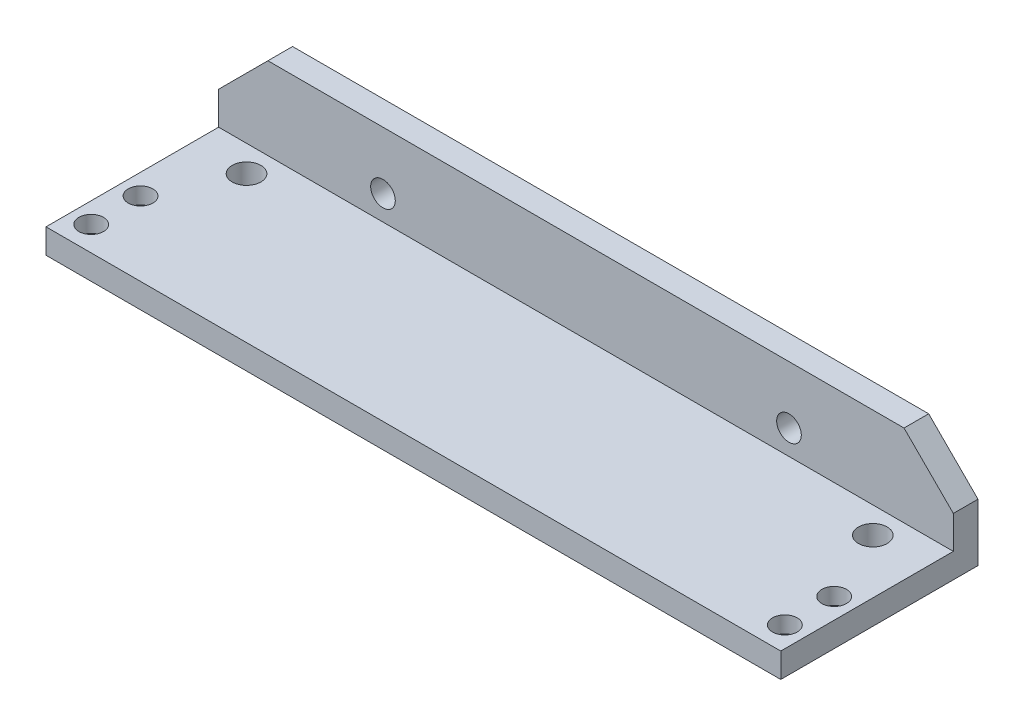
ISO-10303-21;
HEADER;
FILE_DESCRIPTION(('STEP AP214'),'2;1');
FILE_NAME('part.step','',(''),(''),'','','');
FILE_SCHEMA(('AUTOMOTIVE_DESIGN { 1 0 10303 214 1 1 1 1 }'));
ENDSEC;
DATA;
#1=APPLICATION_CONTEXT('core data for automotive mechanical design processes');
#2=APPLICATION_PROTOCOL_DEFINITION('international standard','automotive_design',2000,#1);
#3=PRODUCT_CONTEXT('',#1,'mechanical');
#4=PRODUCT('Part','Part','',(#3));
#5=PRODUCT_RELATED_PRODUCT_CATEGORY('part','',(#4));
#6=PRODUCT_DEFINITION_FORMATION('','',#4);
#7=PRODUCT_DEFINITION_CONTEXT('part definition',#1,'design');
#8=PRODUCT_DEFINITION('design','',#6,#7);
#9=PRODUCT_DEFINITION_SHAPE('','',#8);
#10=(LENGTH_UNIT() NAMED_UNIT(*) SI_UNIT(.MILLI.,.METRE.));
#11=(NAMED_UNIT(*) PLANE_ANGLE_UNIT() SI_UNIT($,.RADIAN.));
#12=(NAMED_UNIT(*) SI_UNIT($,.STERADIAN.) SOLID_ANGLE_UNIT());
#13=UNCERTAINTY_MEASURE_WITH_UNIT(LENGTH_MEASURE(1.E-05),#10,'distance_accuracy_value','');
#14=(GEOMETRIC_REPRESENTATION_CONTEXT(3) GLOBAL_UNCERTAINTY_ASSIGNED_CONTEXT((#13)) GLOBAL_UNIT_ASSIGNED_CONTEXT((#10,
#11,#12)) REPRESENTATION_CONTEXT('',''));
#15=CARTESIAN_POINT('',(0.,0.,0.));
#16=DIRECTION('',(0.,0.,1.));
#17=DIRECTION('',(1.,0.,0.));
#18=AXIS2_PLACEMENT_3D('',#15,#16,#17);
#19=CARTESIAN_POINT('',(0.,-4.10740038617406,24.));
#20=DIRECTION('',(0.,1.,0.));
#21=DIRECTION('',(0.,0.,1.));
#22=AXIS2_PLACEMENT_3D('',#19,#20,#21);
#23=PLANE('',#22);
#24=CARTESIAN_POINT('',(48.6489300998573,-4.10740038617406,15.));
#25=DIRECTION('',(0.,1.,0.));
#26=DIRECTION('',(0.,0.,1.));
#27=AXIS2_PLACEMENT_3D('',#24,#25,#26);
#28=CIRCLE('',#27,2.25);
#29=CARTESIAN_POINT('',(48.6489300998573,-4.10740038617406,17.25));
#30=VERTEX_POINT('',#29);
#31=EDGE_CURVE('E569',#30,#30,#28,.T.);
#32=ORIENTED_EDGE('',*,*,#31,.T.);
#33=EDGE_LOOP('',(#32));
#34=FACE_BOUND('',#33,.T.);
#35=CARTESIAN_POINT('',(-35.7510699001427,-4.10740038617406,15.));
#36=DIRECTION('',(0.,1.,0.));
#37=DIRECTION('',(0.,0.,1.));
#38=AXIS2_PLACEMENT_3D('',#35,#36,#37);
#39=CIRCLE('',#38,2.25);
#40=CARTESIAN_POINT('',(-35.7510699001427,-4.10740038617406,17.25));
#41=VERTEX_POINT('',#40);
#42=EDGE_CURVE('E157',#41,#41,#39,.T.);
#43=ORIENTED_EDGE('',*,*,#42,.T.);
#44=EDGE_LOOP('',(#43));
#45=FACE_BOUND('',#44,.T.);
#46=CARTESIAN_POINT('',(44.5489300998573,-4.10740038617406,6.2));
#47=DIRECTION('',(0.,1.,0.));
#48=DIRECTION('',(0.,0.,1.));
#49=AXIS2_PLACEMENT_3D('',#46,#47,#48);
#50=CIRCLE('',#49,1.75);
#51=CARTESIAN_POINT('',(44.5489300998573,-4.10740038617406,7.95));
#52=VERTEX_POINT('',#51);
#53=EDGE_CURVE('E172',#52,#52,#50,.F.);
#54=ORIENTED_EDGE('',*,*,#53,.F.);
#55=EDGE_LOOP('',(#54));
#56=FACE_BOUND('',#55,.T.);
#57=CARTESIAN_POINT('',(-31.6510699001427,-4.10740038617406,6.2));
#58=DIRECTION('',(0.,1.,0.));
#59=DIRECTION('',(0.,0.,1.));
#60=AXIS2_PLACEMENT_3D('',#57,#58,#59);
#61=CIRCLE('',#60,1.75);
#62=CARTESIAN_POINT('',(-31.6510699001427,-4.10740038617406,7.95));
#63=VERTEX_POINT('',#62);
#64=EDGE_CURVE('E155',#63,#63,#61,.F.);
#65=ORIENTED_EDGE('',*,*,#64,.F.);
#66=EDGE_LOOP('',(#65));
#67=FACE_BOUND('',#66,.T.);
#68=DIRECTION('',(1.,0.,0.));
#69=VECTOR('',#68,1.);
#70=CARTESIAN_POINT('',(0.,-4.10740038617406,0.));
#71=LINE('',#70,#69);
#72=CARTESIAN_POINT('',(-38.2510699001427,-4.10740038617406,0.));
#73=VERTEX_POINT('',#72);
#74=CARTESIAN_POINT('',(51.1489300998573,-4.10740038617406,0.));
#75=VERTEX_POINT('',#74);
#76=EDGE_CURVE('E190',#73,#75,#71,.T.);
#77=ORIENTED_EDGE('',*,*,#76,.T.);
#78=DIRECTION('',(0.,0.,-1.));
#79=VECTOR('',#78,1.);
#80=CARTESIAN_POINT('',(51.1489300998573,-4.10740038617406,24.));
#81=LINE('',#80,#79);
#82=CARTESIAN_POINT('',(51.1489300998573,-4.10740038617406,24.));
#83=VERTEX_POINT('',#82);
#84=EDGE_CURVE('E134',#83,#75,#81,.T.);
#85=ORIENTED_EDGE('',*,*,#84,.F.);
#86=DIRECTION('',(1.,0.,0.));
#87=VECTOR('',#86,1.);
#88=CARTESIAN_POINT('',(0.,-4.10740038617406,24.));
#89=LINE('',#88,#87);
#90=CARTESIAN_POINT('',(-38.2510699001427,-4.10740038617406,24.));
#91=VERTEX_POINT('',#90);
#92=EDGE_CURVE('E191',#91,#83,#89,.T.);
#93=ORIENTED_EDGE('',*,*,#92,.F.);
#94=DIRECTION('',(0.,0.,-1.));
#95=VECTOR('',#94,1.);
#96=CARTESIAN_POINT('',(-38.2510699001427,-4.10740038617406,24.));
#97=LINE('',#96,#95);
#98=EDGE_CURVE('E202',#91,#73,#97,.T.);
#99=ORIENTED_EDGE('',*,*,#98,.T.);
#100=EDGE_LOOP('',(#77,#85,#93,#99));
#101=FACE_BOUND('',#100,.T.);
#102=CARTESIAN_POINT('',(48.6489300998573,-4.10740038617406,21.));
#103=DIRECTION('',(0.,1.,0.));
#104=DIRECTION('',(0.,0.,1.));
#105=AXIS2_PLACEMENT_3D('',#102,#103,#104);
#106=CIRCLE('',#105,2.25);
#107=CARTESIAN_POINT('',(48.6489300998573,-4.10740038617406,23.25));
#108=VERTEX_POINT('',#107);
#109=EDGE_CURVE('E575',#108,#108,#106,.T.);
#110=ORIENTED_EDGE('',*,*,#109,.T.);
#111=EDGE_LOOP('',(#110));
#112=FACE_BOUND('',#111,.T.);
#113=CARTESIAN_POINT('',(-35.7510699001427,-4.10740038617406,21.));
#114=DIRECTION('',(0.,1.,0.));
#115=DIRECTION('',(0.,0.,1.));
#116=AXIS2_PLACEMENT_3D('',#113,#114,#115);
#117=CIRCLE('',#116,2.25);
#118=CARTESIAN_POINT('',(-35.7510699001427,-4.10740038617406,23.25));
#119=VERTEX_POINT('',#118);
#120=EDGE_CURVE('E573',#119,#119,#117,.T.);
#121=ORIENTED_EDGE('',*,*,#120,.T.);
#122=EDGE_LOOP('',(#121));
#123=FACE_BOUND('',#122,.T.);
#124=ADVANCED_FACE('F48',(#34,#45,#56,#67,#101,#112,#123),#23,.F.);
#125=CARTESIAN_POINT('',(51.1489300998573,0.,3.));
#126=DIRECTION('',(-1.,0.,0.));
#127=DIRECTION('',(0.,0.,1.));
#128=AXIS2_PLACEMENT_3D('',#125,#126,#127);
#129=PLANE('',#128);
#130=DIRECTION('',(0.,1.,0.));
#131=VECTOR('',#130,1.);
#132=CARTESIAN_POINT('',(51.1489300998573,0.,0.));
#133=LINE('',#132,#131);
#134=CARTESIAN_POINT('',(51.1489300998573,2.89259961382594,0.));
#135=VERTEX_POINT('',#134);
#136=EDGE_CURVE('E137',#75,#135,#133,.T.);
#137=ORIENTED_EDGE('',*,*,#136,.T.);
#138=DIRECTION('',(0.,0.,-1.));
#139=VECTOR('',#138,1.);
#140=CARTESIAN_POINT('',(51.1489300998573,2.89259961382594,3.));
#141=LINE('',#140,#139);
#142=CARTESIAN_POINT('',(51.1489300998573,2.89259961382594,3.));
#143=VERTEX_POINT('',#142);
#144=EDGE_CURVE('E12',#143,#135,#141,.T.);
#145=ORIENTED_EDGE('',*,*,#144,.F.);
#146=DIRECTION('',(0.,1.,0.));
#147=VECTOR('',#146,1.);
#148=CARTESIAN_POINT('',(51.1489300998573,0.,3.));
#149=LINE('',#148,#147);
#150=CARTESIAN_POINT('',(51.1489300998573,-1.10740038617406,3.));
#151=VERTEX_POINT('',#150);
#152=EDGE_CURVE('E218',#151,#143,#149,.T.);
#153=ORIENTED_EDGE('',*,*,#152,.F.);
#154=DIRECTION('',(0.,0.,-1.));
#155=VECTOR('',#154,1.);
#156=CARTESIAN_POINT('',(51.1489300998573,-1.10740038617406,24.));
#157=LINE('',#156,#155);
#158=CARTESIAN_POINT('',(51.1489300998573,-1.10740038617406,24.));
#159=VERTEX_POINT('',#158);
#160=EDGE_CURVE('E67',#159,#151,#157,.T.);
#161=ORIENTED_EDGE('',*,*,#160,.F.);
#162=DIRECTION('',(0.,1.,0.));
#163=VECTOR('',#162,1.);
#164=CARTESIAN_POINT('',(51.1489300998573,0.,24.));
#165=LINE('',#164,#163);
#166=EDGE_CURVE('E194',#83,#159,#165,.T.);
#167=ORIENTED_EDGE('',*,*,#166,.F.);
#168=ORIENTED_EDGE('',*,*,#84,.T.);
#169=EDGE_LOOP('',(#137,#145,#153,#161,#167,#168));
#170=FACE_BOUND('',#169,.T.);
#171=ADVANCED_FACE('F222',(#170),#129,.F.);
#172=CARTESIAN_POINT('',(27.0207648568417,27.0207648568416,3.));
#173=DIRECTION('',(-0.707106781186548,-0.707106781186547,0.));
#174=DIRECTION('',(0.707106781186547,-0.707106781186548,0.));
#175=AXIS2_PLACEMENT_3D('',#172,#173,#174);
#176=PLANE('',#175);
#177=DIRECTION('',(-0.707106781186547,0.707106781186548,0.));
#178=VECTOR('',#177,1.);
#179=CARTESIAN_POINT('',(27.0207648568417,27.0207648568416,0.));
#180=LINE('',#179,#178);
#181=CARTESIAN_POINT('',(45.1489300998574,8.89259961382595,0.));
#182=VERTEX_POINT('',#181);
#183=EDGE_CURVE('E140',#135,#182,#180,.T.);
#184=ORIENTED_EDGE('',*,*,#183,.T.);
#185=DIRECTION('',(0.,0.,-1.));
#186=VECTOR('',#185,1.);
#187=CARTESIAN_POINT('',(45.1489300998574,8.89259961382595,3.));
#188=LINE('',#187,#186);
#189=CARTESIAN_POINT('',(45.1489300998574,8.89259961382595,3.));
#190=VERTEX_POINT('',#189);
#191=EDGE_CURVE('E58',#190,#182,#188,.T.);
#192=ORIENTED_EDGE('',*,*,#191,.F.);
#193=DIRECTION('',(-0.707106781186547,0.707106781186548,0.));
#194=VECTOR('',#193,1.);
#195=CARTESIAN_POINT('',(27.0207648568417,27.0207648568416,3.));
#196=LINE('',#195,#194);
#197=EDGE_CURVE('E101',#143,#190,#196,.T.);
#198=ORIENTED_EDGE('',*,*,#197,.F.);
#199=ORIENTED_EDGE('',*,*,#144,.T.);
#200=EDGE_LOOP('',(#184,#192,#198,#199));
#201=FACE_BOUND('',#200,.T.);
#202=ADVANCED_FACE('F224',(#201),#176,.F.);
#203=CARTESIAN_POINT('',(0.,8.89259961382594,3.));
#204=DIRECTION('',(0.,-1.,0.));
#205=DIRECTION('',(1.,0.,0.));
#206=AXIS2_PLACEMENT_3D('',#203,#204,#205);
#207=PLANE('',#206);
#208=DIRECTION('',(-1.,0.,0.));
#209=VECTOR('',#208,1.);
#210=CARTESIAN_POINT('',(0.,8.89259961382594,0.));
#211=LINE('',#210,#209);
#212=CARTESIAN_POINT('',(-32.2510699001427,8.89259961382594,0.));
#213=VERTEX_POINT('',#212);
#214=EDGE_CURVE('E119',#182,#213,#211,.T.);
#215=ORIENTED_EDGE('',*,*,#214,.T.);
#216=DIRECTION('',(0.,0.,-1.));
#217=VECTOR('',#216,1.);
#218=CARTESIAN_POINT('',(-32.2510699001427,8.89259961382594,3.));
#219=LINE('',#218,#217);
#220=CARTESIAN_POINT('',(-32.2510699001427,8.89259961382594,3.));
#221=VERTEX_POINT('',#220);
#222=EDGE_CURVE('E86',#221,#213,#219,.T.);
#223=ORIENTED_EDGE('',*,*,#222,.F.);
#224=DIRECTION('',(-1.,0.,0.));
#225=VECTOR('',#224,1.);
#226=CARTESIAN_POINT('',(0.,8.89259961382594,3.));
#227=LINE('',#226,#225);
#228=EDGE_CURVE('E110',#190,#221,#227,.T.);
#229=ORIENTED_EDGE('',*,*,#228,.F.);
#230=ORIENTED_EDGE('',*,*,#191,.T.);
#231=EDGE_LOOP('',(#215,#223,#229,#230));
#232=FACE_BOUND('',#231,.T.);
#233=ADVANCED_FACE('F117',(#232),#207,.F.);
#234=CARTESIAN_POINT('',(-20.5718347569843,20.5718347569843,3.));
#235=DIRECTION('',(-0.707106781186548,0.707106781186547,0.));
#236=DIRECTION('',(-0.707106781186547,-0.707106781186548,0.));
#237=AXIS2_PLACEMENT_3D('',#234,#235,#236);
#238=PLANE('',#237);
#239=DIRECTION('',(0.707106781186547,0.707106781186548,0.));
#240=VECTOR('',#239,1.);
#241=CARTESIAN_POINT('',(-20.5718347569843,20.5718347569843,0.));
#242=LINE('',#241,#240);
#243=CARTESIAN_POINT('',(-38.2510699001427,2.89259961382594,0.));
#244=VERTEX_POINT('',#243);
#245=EDGE_CURVE('E143',#244,#213,#242,.T.);
#246=ORIENTED_EDGE('',*,*,#245,.F.);
#247=DIRECTION('',(0.,0.,-1.));
#248=VECTOR('',#247,1.);
#249=CARTESIAN_POINT('',(-38.2510699001427,2.89259961382594,3.));
#250=LINE('',#249,#248);
#251=CARTESIAN_POINT('',(-38.2510699001427,2.89259961382594,3.));
#252=VERTEX_POINT('',#251);
#253=EDGE_CURVE('E93',#252,#244,#250,.T.);
#254=ORIENTED_EDGE('',*,*,#253,.F.);
#255=DIRECTION('',(0.707106781186547,0.707106781186548,0.));
#256=VECTOR('',#255,1.);
#257=CARTESIAN_POINT('',(-20.5718347569843,20.5718347569843,3.));
#258=LINE('',#257,#256);
#259=EDGE_CURVE('E113',#252,#221,#258,.T.);
#260=ORIENTED_EDGE('',*,*,#259,.T.);
#261=ORIENTED_EDGE('',*,*,#222,.T.);
#262=EDGE_LOOP('',(#246,#254,#260,#261));
#263=FACE_BOUND('',#262,.T.);
#264=ADVANCED_FACE('F122',(#263),#238,.T.);
#265=CARTESIAN_POINT('',(-38.2510699001427,0.,3.));
#266=DIRECTION('',(1.,0.,0.));
#267=DIRECTION('',(0.,0.,-1.));
#268=AXIS2_PLACEMENT_3D('',#265,#266,#267);
#269=PLANE('',#268);
#270=DIRECTION('',(0.,-1.,0.));
#271=VECTOR('',#270,1.);
#272=CARTESIAN_POINT('',(-38.2510699001427,0.,0.));
#273=LINE('',#272,#271);
#274=EDGE_CURVE('E145',#244,#73,#273,.T.);
#275=ORIENTED_EDGE('',*,*,#274,.T.);
#276=ORIENTED_EDGE('',*,*,#98,.F.);
#277=DIRECTION('',(0.,-1.,0.));
#278=VECTOR('',#277,1.);
#279=CARTESIAN_POINT('',(-38.2510699001427,0.,24.));
#280=LINE('',#279,#278);
#281=CARTESIAN_POINT('',(-38.2510699001427,-1.10740038617406,24.));
#282=VERTEX_POINT('',#281);
#283=EDGE_CURVE('E199',#282,#91,#280,.T.);
#284=ORIENTED_EDGE('',*,*,#283,.F.);
#285=DIRECTION('',(0.,0.,-1.));
#286=VECTOR('',#285,1.);
#287=CARTESIAN_POINT('',(-38.2510699001427,-1.10740038617406,24.));
#288=LINE('',#287,#286);
#289=CARTESIAN_POINT('',(-38.2510699001427,-1.10740038617406,3.));
#290=VERTEX_POINT('',#289);
#291=EDGE_CURVE('E207',#282,#290,#288,.T.);
#292=ORIENTED_EDGE('',*,*,#291,.T.);
#293=DIRECTION('',(0.,-1.,0.));
#294=VECTOR('',#293,1.);
#295=CARTESIAN_POINT('',(-38.2510699001427,0.,3.));
#296=LINE('',#295,#294);
#297=EDGE_CURVE('E123',#252,#290,#296,.T.);
#298=ORIENTED_EDGE('',*,*,#297,.F.);
#299=ORIENTED_EDGE('',*,*,#253,.T.);
#300=EDGE_LOOP('',(#275,#276,#284,#292,#298,#299));
#301=FACE_BOUND('',#300,.T.);
#302=ADVANCED_FACE('F230',(#301),#269,.F.);
#303=CARTESIAN_POINT('',(-18.2510699001427,1.89259961382594,3.));
#304=DIRECTION('',(0.,0.,-1.));
#305=DIRECTION('',(-1.,0.,0.));
#306=AXIS2_PLACEMENT_3D('',#303,#304,#305);
#307=CYLINDRICAL_SURFACE('',#306,1.5);
#308=CARTESIAN_POINT('',(-18.2510699001427,1.89259961382594,3.));
#309=DIRECTION('',(0.,0.,1.));
#310=DIRECTION('',(1.,0.,0.));
#311=AXIS2_PLACEMENT_3D('',#308,#309,#310);
#312=CIRCLE('',#311,1.5);
#313=CARTESIAN_POINT('',(-16.7510699001427,1.89259961382594,3.));
#314=VERTEX_POINT('',#313);
#315=EDGE_CURVE('E215',#314,#314,#312,.T.);
#316=ORIENTED_EDGE('',*,*,#315,.T.);
#317=EDGE_LOOP('',(#316));
#318=FACE_BOUND('',#317,.T.);
#319=CARTESIAN_POINT('',(-18.2510699001427,1.89259961382594,0.));
#320=DIRECTION('',(0.,0.,1.));
#321=DIRECTION('',(1.,0.,0.));
#322=AXIS2_PLACEMENT_3D('',#319,#320,#321);
#323=CIRCLE('',#322,1.5);
#324=CARTESIAN_POINT('',(-16.7510699001427,1.89259961382594,0.));
#325=VERTEX_POINT('',#324);
#326=EDGE_CURVE('E133',#325,#325,#323,.T.);
#327=ORIENTED_EDGE('',*,*,#326,.F.);
#328=EDGE_LOOP('',(#327));
#329=FACE_BOUND('',#328,.T.);
#330=ADVANCED_FACE('F280',(#318,#329),#307,.F.);
#331=CARTESIAN_POINT('',(31.1489300998573,1.89259961382594,3.));
#332=DIRECTION('',(0.,0.,-1.));
#333=DIRECTION('',(-1.,0.,0.));
#334=AXIS2_PLACEMENT_3D('',#331,#332,#333);
#335=CYLINDRICAL_SURFACE('',#334,1.5);
#336=CARTESIAN_POINT('',(31.1489300998573,1.89259961382594,3.));
#337=DIRECTION('',(0.,0.,1.));
#338=DIRECTION('',(1.,0.,0.));
#339=AXIS2_PLACEMENT_3D('',#336,#337,#338);
#340=CIRCLE('',#339,1.5);
#341=CARTESIAN_POINT('',(32.6489300998573,1.89259961382594,3.));
#342=VERTEX_POINT('',#341);
#343=EDGE_CURVE('E147',#342,#342,#340,.T.);
#344=ORIENTED_EDGE('',*,*,#343,.T.);
#345=EDGE_LOOP('',(#344));
#346=FACE_BOUND('',#345,.T.);
#347=CARTESIAN_POINT('',(31.1489300998573,1.89259961382594,0.));
#348=DIRECTION('',(0.,0.,1.));
#349=DIRECTION('',(1.,0.,0.));
#350=AXIS2_PLACEMENT_3D('',#347,#348,#349);
#351=CIRCLE('',#350,1.5);
#352=CARTESIAN_POINT('',(32.6489300998573,1.89259961382594,0.));
#353=VERTEX_POINT('',#352);
#354=EDGE_CURVE('E130',#353,#353,#351,.T.);
#355=ORIENTED_EDGE('',*,*,#354,.F.);
#356=EDGE_LOOP('',(#355));
#357=FACE_BOUND('',#356,.T.);
#358=ADVANCED_FACE('F50',(#346,#357),#335,.F.);
#359=CARTESIAN_POINT('',(0.,0.,3.));
#360=DIRECTION('',(0.,0.,1.));
#361=DIRECTION('',(1.,0.,0.));
#362=AXIS2_PLACEMENT_3D('',#359,#360,#361);
#363=PLANE('',#362);
#364=ORIENTED_EDGE('',*,*,#343,.F.);
#365=EDGE_LOOP('',(#364));
#366=FACE_BOUND('',#365,.T.);
#367=ORIENTED_EDGE('',*,*,#315,.F.);
#368=EDGE_LOOP('',(#367));
#369=FACE_BOUND('',#368,.T.);
#370=ORIENTED_EDGE('',*,*,#152,.T.);
#371=ORIENTED_EDGE('',*,*,#197,.T.);
#372=ORIENTED_EDGE('',*,*,#228,.T.);
#373=ORIENTED_EDGE('',*,*,#259,.F.);
#374=ORIENTED_EDGE('',*,*,#297,.T.);
#375=DIRECTION('',(1.,0.,0.));
#376=VECTOR('',#375,1.);
#377=CARTESIAN_POINT('',(0.,-1.10740038617406,3.));
#378=LINE('',#377,#376);
#379=EDGE_CURVE('E125',#290,#151,#378,.T.);
#380=ORIENTED_EDGE('',*,*,#379,.T.);
#381=EDGE_LOOP('',(#370,#371,#372,#373,#374,#380));
#382=FACE_BOUND('',#381,.T.);
#383=ADVANCED_FACE('F111',(#366,#369,#382),#363,.T.);
#384=CARTESIAN_POINT('',(0.,0.,0.));
#385=DIRECTION('',(0.,0.,1.));
#386=DIRECTION('',(1.,0.,0.));
#387=AXIS2_PLACEMENT_3D('',#384,#385,#386);
#388=PLANE('',#387);
#389=ORIENTED_EDGE('',*,*,#354,.T.);
#390=EDGE_LOOP('',(#389));
#391=FACE_BOUND('',#390,.T.);
#392=ORIENTED_EDGE('',*,*,#326,.T.);
#393=EDGE_LOOP('',(#392));
#394=FACE_BOUND('',#393,.T.);
#395=ORIENTED_EDGE('',*,*,#136,.F.);
#396=ORIENTED_EDGE('',*,*,#76,.F.);
#397=ORIENTED_EDGE('',*,*,#274,.F.);
#398=ORIENTED_EDGE('',*,*,#245,.T.);
#399=ORIENTED_EDGE('',*,*,#214,.F.);
#400=ORIENTED_EDGE('',*,*,#183,.F.);
#401=EDGE_LOOP('',(#395,#396,#397,#398,#399,#400));
#402=FACE_BOUND('',#401,.T.);
#403=ADVANCED_FACE('F226',(#391,#394,#402),#388,.F.);
#404=CARTESIAN_POINT('',(0.,-1.10740038617406,24.));
#405=DIRECTION('',(0.,1.,0.));
#406=DIRECTION('',(0.,0.,1.));
#407=AXIS2_PLACEMENT_3D('',#404,#405,#406);
#408=PLANE('',#407);
#409=CARTESIAN_POINT('',(44.5489300998573,-1.10740038617406,6.2));
#410=DIRECTION('',(0.,1.,0.));
#411=DIRECTION('',(0.,0.,1.));
#412=AXIS2_PLACEMENT_3D('',#409,#410,#411);
#413=CIRCLE('',#412,1.75);
#414=CARTESIAN_POINT('',(44.5489300998573,-1.10740038617406,7.95));
#415=VERTEX_POINT('',#414);
#416=EDGE_CURVE('E177',#415,#415,#413,.T.);
#417=ORIENTED_EDGE('',*,*,#416,.F.);
#418=EDGE_LOOP('',(#417));
#419=FACE_BOUND('',#418,.T.);
#420=CARTESIAN_POINT('',(-35.7510699001427,-1.10740038617406,21.));
#421=DIRECTION('',(0.,1.,0.));
#422=DIRECTION('',(0.,0.,1.));
#423=AXIS2_PLACEMENT_3D('',#420,#421,#422);
#424=CIRCLE('',#423,1.5);
#425=CARTESIAN_POINT('',(-35.7510699001427,-1.10740038617406,22.5));
#426=VERTEX_POINT('',#425);
#427=EDGE_CURVE('E173',#426,#426,#424,.T.);
#428=ORIENTED_EDGE('',*,*,#427,.F.);
#429=EDGE_LOOP('',(#428));
#430=FACE_BOUND('',#429,.T.);
#431=CARTESIAN_POINT('',(-35.7510699001427,-1.10740038617406,15.));
#432=DIRECTION('',(0.,1.,0.));
#433=DIRECTION('',(0.,0.,1.));
#434=AXIS2_PLACEMENT_3D('',#431,#432,#433);
#435=CIRCLE('',#434,1.5);
#436=CARTESIAN_POINT('',(-35.7510699001427,-1.10740038617406,16.5));
#437=VERTEX_POINT('',#436);
#438=EDGE_CURVE('E176',#437,#437,#435,.T.);
#439=ORIENTED_EDGE('',*,*,#438,.F.);
#440=EDGE_LOOP('',(#439));
#441=FACE_BOUND('',#440,.T.);
#442=CARTESIAN_POINT('',(48.6489300998573,-1.10740038617406,21.));
#443=DIRECTION('',(0.,1.,0.));
#444=DIRECTION('',(0.,0.,1.));
#445=AXIS2_PLACEMENT_3D('',#442,#443,#444);
#446=CIRCLE('',#445,1.5);
#447=CARTESIAN_POINT('',(48.6489300998573,-1.10740038617406,22.5));
#448=VERTEX_POINT('',#447);
#449=EDGE_CURVE('E182',#448,#448,#446,.T.);
#450=ORIENTED_EDGE('',*,*,#449,.F.);
#451=EDGE_LOOP('',(#450));
#452=FACE_BOUND('',#451,.T.);
#453=CARTESIAN_POINT('',(-31.6510699001427,-1.10740038617406,6.2));
#454=DIRECTION('',(0.,1.,0.));
#455=DIRECTION('',(0.,0.,1.));
#456=AXIS2_PLACEMENT_3D('',#453,#454,#455);
#457=CIRCLE('',#456,1.75);
#458=CARTESIAN_POINT('',(-31.6510699001427,-1.10740038617406,7.95));
#459=VERTEX_POINT('',#458);
#460=EDGE_CURVE('E169',#459,#459,#457,.T.);
#461=ORIENTED_EDGE('',*,*,#460,.F.);
#462=EDGE_LOOP('',(#461));
#463=FACE_BOUND('',#462,.T.);
#464=CARTESIAN_POINT('',(48.6489300998573,-1.10740038617406,15.));
#465=DIRECTION('',(0.,1.,0.));
#466=DIRECTION('',(0.,0.,1.));
#467=AXIS2_PLACEMENT_3D('',#464,#465,#466);
#468=CIRCLE('',#467,1.5);
#469=CARTESIAN_POINT('',(48.6489300998573,-1.10740038617406,16.5));
#470=VERTEX_POINT('',#469);
#471=EDGE_CURVE('E185',#470,#470,#468,.T.);
#472=ORIENTED_EDGE('',*,*,#471,.F.);
#473=EDGE_LOOP('',(#472));
#474=FACE_BOUND('',#473,.T.);
#475=ORIENTED_EDGE('',*,*,#379,.F.);
#476=ORIENTED_EDGE('',*,*,#291,.F.);
#477=DIRECTION('',(1.,0.,0.));
#478=VECTOR('',#477,1.);
#479=CARTESIAN_POINT('',(0.,-1.10740038617406,24.));
#480=LINE('',#479,#478);
#481=EDGE_CURVE('E197',#282,#159,#480,.T.);
#482=ORIENTED_EDGE('',*,*,#481,.T.);
#483=ORIENTED_EDGE('',*,*,#160,.T.);
#484=EDGE_LOOP('',(#475,#476,#482,#483));
#485=FACE_BOUND('',#484,.T.);
#486=ADVANCED_FACE('F251',(#419,#430,#441,#452,#463,#474,#485),#408,.T.);
#487=CARTESIAN_POINT('',(0.,0.,24.));
#488=DIRECTION('',(0.,0.,1.));
#489=DIRECTION('',(1.,0.,0.));
#490=AXIS2_PLACEMENT_3D('',#487,#488,#489);
#491=PLANE('',#490);
#492=ORIENTED_EDGE('',*,*,#92,.T.);
#493=ORIENTED_EDGE('',*,*,#166,.T.);
#494=ORIENTED_EDGE('',*,*,#481,.F.);
#495=ORIENTED_EDGE('',*,*,#283,.T.);
#496=EDGE_LOOP('',(#492,#493,#494,#495));
#497=FACE_BOUND('',#496,.T.);
#498=ADVANCED_FACE('F242',(#497),#491,.T.);
#499=CARTESIAN_POINT('',(48.6489300998573,-4.10840038617406,15.));
#500=DIRECTION('',(0.,1.,0.));
#501=DIRECTION('',(0.,0.,1.));
#502=AXIS2_PLACEMENT_3D('',#499,#500,#501);
#503=CYLINDRICAL_SURFACE('',#502,1.5);
#504=CARTESIAN_POINT('',(48.6489300998573,-3.10740038617406,15.));
#505=DIRECTION('',(0.,1.,0.));
#506=DIRECTION('',(0.,0.,1.));
#507=AXIS2_PLACEMENT_3D('',#504,#505,#506);
#508=CIRCLE('',#507,1.5);
#509=CARTESIAN_POINT('',(48.6489300998573,-3.10740038617406,16.5));
#510=VERTEX_POINT('',#509);
#511=EDGE_CURVE('E52',#510,#510,#508,.F.);
#512=ORIENTED_EDGE('',*,*,#511,.T.);
#513=EDGE_LOOP('',(#512));
#514=FACE_BOUND('',#513,.T.);
#515=ORIENTED_EDGE('',*,*,#471,.T.);
#516=EDGE_LOOP('',(#515));
#517=FACE_BOUND('',#516,.T.);
#518=ADVANCED_FACE('F259',(#514,#517),#503,.F.);
#519=CARTESIAN_POINT('',(-31.6510699001427,-4.10840038617406,6.2));
#520=DIRECTION('',(0.,1.,0.));
#521=DIRECTION('',(0.,0.,1.));
#522=AXIS2_PLACEMENT_3D('',#519,#520,#521);
#523=CYLINDRICAL_SURFACE('',#522,1.75);
#524=ORIENTED_EDGE('',*,*,#460,.T.);
#525=EDGE_LOOP('',(#524));
#526=FACE_BOUND('',#525,.T.);
#527=ORIENTED_EDGE('',*,*,#64,.T.);
#528=EDGE_LOOP('',(#527));
#529=FACE_BOUND('',#528,.T.);
#530=ADVANCED_FACE('F340',(#526,#529),#523,.F.);
#531=CARTESIAN_POINT('',(48.6489300998573,-4.10840038617406,21.));
#532=DIRECTION('',(0.,1.,0.));
#533=DIRECTION('',(0.,0.,1.));
#534=AXIS2_PLACEMENT_3D('',#531,#532,#533);
#535=CYLINDRICAL_SURFACE('',#534,1.5);
#536=CARTESIAN_POINT('',(48.6489300998573,-3.10740038617406,21.));
#537=DIRECTION('',(0.,1.,0.));
#538=DIRECTION('',(0.,0.,1.));
#539=AXIS2_PLACEMENT_3D('',#536,#537,#538);
#540=CIRCLE('',#539,1.5);
#541=CARTESIAN_POINT('',(48.6489300998573,-3.10740038617406,22.5));
#542=VERTEX_POINT('',#541);
#543=EDGE_CURVE('E149',#542,#542,#540,.F.);
#544=ORIENTED_EDGE('',*,*,#543,.T.);
#545=EDGE_LOOP('',(#544));
#546=FACE_BOUND('',#545,.T.);
#547=ORIENTED_EDGE('',*,*,#449,.T.);
#548=EDGE_LOOP('',(#547));
#549=FACE_BOUND('',#548,.T.);
#550=ADVANCED_FACE('F346',(#546,#549),#535,.F.);
#551=CARTESIAN_POINT('',(-35.7510699001427,-4.10840038617406,15.));
#552=DIRECTION('',(0.,1.,0.));
#553=DIRECTION('',(0.,0.,1.));
#554=AXIS2_PLACEMENT_3D('',#551,#552,#553);
#555=CYLINDRICAL_SURFACE('',#554,1.5);
#556=CARTESIAN_POINT('',(-35.7510699001427,-3.10740038617406,15.));
#557=DIRECTION('',(0.,1.,0.));
#558=DIRECTION('',(0.,0.,1.));
#559=AXIS2_PLACEMENT_3D('',#556,#557,#558);
#560=CIRCLE('',#559,1.5);
#561=CARTESIAN_POINT('',(-35.7510699001427,-3.10740038617406,16.5));
#562=VERTEX_POINT('',#561);
#563=EDGE_CURVE('E162',#562,#562,#560,.T.);
#564=ORIENTED_EDGE('',*,*,#563,.F.);
#565=EDGE_LOOP('',(#564));
#566=FACE_BOUND('',#565,.T.);
#567=ORIENTED_EDGE('',*,*,#438,.T.);
#568=EDGE_LOOP('',(#567));
#569=FACE_BOUND('',#568,.T.);
#570=ADVANCED_FACE('F390',(#566,#569),#555,.F.);
#571=CARTESIAN_POINT('',(-35.7510699001427,-4.10840038617406,21.));
#572=DIRECTION('',(0.,1.,0.));
#573=DIRECTION('',(0.,0.,1.));
#574=AXIS2_PLACEMENT_3D('',#571,#572,#573);
#575=CYLINDRICAL_SURFACE('',#574,1.5);
#576=CARTESIAN_POINT('',(-35.7510699001427,-3.10740038617406,21.));
#577=DIRECTION('',(0.,1.,0.));
#578=DIRECTION('',(0.,0.,1.));
#579=AXIS2_PLACEMENT_3D('',#576,#577,#578);
#580=CIRCLE('',#579,1.5);
#581=CARTESIAN_POINT('',(-35.7510699001427,-3.10740038617406,22.5));
#582=VERTEX_POINT('',#581);
#583=EDGE_CURVE('E577',#582,#582,#580,.T.);
#584=ORIENTED_EDGE('',*,*,#583,.F.);
#585=EDGE_LOOP('',(#584));
#586=FACE_BOUND('',#585,.T.);
#587=ORIENTED_EDGE('',*,*,#427,.T.);
#588=EDGE_LOOP('',(#587));
#589=FACE_BOUND('',#588,.T.);
#590=ADVANCED_FACE('F362',(#586,#589),#575,.F.);
#591=CARTESIAN_POINT('',(44.5489300998573,-4.10840038617406,6.2));
#592=DIRECTION('',(0.,1.,0.));
#593=DIRECTION('',(0.,0.,1.));
#594=AXIS2_PLACEMENT_3D('',#591,#592,#593);
#595=CYLINDRICAL_SURFACE('',#594,1.75);
#596=ORIENTED_EDGE('',*,*,#416,.T.);
#597=EDGE_LOOP('',(#596));
#598=FACE_BOUND('',#597,.T.);
#599=ORIENTED_EDGE('',*,*,#53,.T.);
#600=EDGE_LOOP('',(#599));
#601=FACE_BOUND('',#600,.T.);
#602=ADVANCED_FACE('F355',(#598,#601),#595,.F.);
#603=CARTESIAN_POINT('',(-35.7510699001427,-3.10740038617406,21.));
#604=DIRECTION('',(0.,1.,0.));
#605=DIRECTION('',(0.,0.,1.));
#606=AXIS2_PLACEMENT_3D('',#603,#604,#605);
#607=PLANE('',#606);
#608=CARTESIAN_POINT('',(-35.7510699001427,-3.10740038617406,21.));
#609=DIRECTION('',(0.,1.,0.));
#610=DIRECTION('',(0.,0.,1.));
#611=AXIS2_PLACEMENT_3D('',#608,#609,#610);
#612=CIRCLE('',#611,2.25);
#613=CARTESIAN_POINT('',(-35.7510699001427,-3.10740038617406,23.25));
#614=VERTEX_POINT('',#613);
#615=EDGE_CURVE('E570',#614,#614,#612,.T.);
#616=ORIENTED_EDGE('',*,*,#615,.F.);
#617=EDGE_LOOP('',(#616));
#618=FACE_BOUND('',#617,.T.);
#619=ORIENTED_EDGE('',*,*,#583,.T.);
#620=EDGE_LOOP('',(#619));
#621=FACE_BOUND('',#620,.T.);
#622=ADVANCED_FACE('F361',(#618,#621),#607,.F.);
#623=CARTESIAN_POINT('',(-35.7510699001427,-3.10740038617406,21.));
#624=DIRECTION('',(0.,-1.,0.));
#625=DIRECTION('',(0.,0.,-1.));
#626=AXIS2_PLACEMENT_3D('',#623,#624,#625);
#627=CYLINDRICAL_SURFACE('',#626,2.25);
#628=ORIENTED_EDGE('',*,*,#615,.T.);
#629=EDGE_LOOP('',(#628));
#630=FACE_BOUND('',#629,.T.);
#631=ORIENTED_EDGE('',*,*,#120,.F.);
#632=EDGE_LOOP('',(#631));
#633=FACE_BOUND('',#632,.T.);
#634=ADVANCED_FACE('F417',(#630,#633),#627,.F.);
#635=CARTESIAN_POINT('',(-35.7510699001427,-3.10740038617406,15.));
#636=DIRECTION('',(0.,1.,0.));
#637=DIRECTION('',(0.,0.,1.));
#638=AXIS2_PLACEMENT_3D('',#635,#636,#637);
#639=PLANE('',#638);
#640=CARTESIAN_POINT('',(-35.7510699001427,-3.10740038617406,15.));
#641=DIRECTION('',(0.,1.,0.));
#642=DIRECTION('',(0.,0.,1.));
#643=AXIS2_PLACEMENT_3D('',#640,#641,#642);
#644=CIRCLE('',#643,2.25);
#645=CARTESIAN_POINT('',(-35.7510699001427,-3.10740038617406,17.25));
#646=VERTEX_POINT('',#645);
#647=EDGE_CURVE('E151',#646,#646,#644,.T.);
#648=ORIENTED_EDGE('',*,*,#647,.F.);
#649=EDGE_LOOP('',(#648));
#650=FACE_BOUND('',#649,.T.);
#651=ORIENTED_EDGE('',*,*,#563,.T.);
#652=EDGE_LOOP('',(#651));
#653=FACE_BOUND('',#652,.T.);
#654=ADVANCED_FACE('F428',(#650,#653),#639,.F.);
#655=CARTESIAN_POINT('',(-35.7510699001427,-3.10740038617406,15.));
#656=DIRECTION('',(0.,-1.,0.));
#657=DIRECTION('',(0.,0.,-1.));
#658=AXIS2_PLACEMENT_3D('',#655,#656,#657);
#659=CYLINDRICAL_SURFACE('',#658,2.25);
#660=ORIENTED_EDGE('',*,*,#647,.T.);
#661=EDGE_LOOP('',(#660));
#662=FACE_BOUND('',#661,.T.);
#663=ORIENTED_EDGE('',*,*,#42,.F.);
#664=EDGE_LOOP('',(#663));
#665=FACE_BOUND('',#664,.T.);
#666=ADVANCED_FACE('F438',(#662,#665),#659,.F.);
#667=CARTESIAN_POINT('',(48.6489300998573,-3.10740038617406,21.));
#668=DIRECTION('',(0.,1.,0.));
#669=DIRECTION('',(0.,0.,1.));
#670=AXIS2_PLACEMENT_3D('',#667,#668,#669);
#671=PLANE('',#670);
#672=CARTESIAN_POINT('',(48.6489300998573,-3.10740038617406,21.));
#673=DIRECTION('',(0.,1.,0.));
#674=DIRECTION('',(0.,0.,1.));
#675=AXIS2_PLACEMENT_3D('',#672,#673,#674);
#676=CIRCLE('',#675,2.25);
#677=CARTESIAN_POINT('',(48.6489300998573,-3.10740038617406,23.25));
#678=VERTEX_POINT('',#677);
#679=EDGE_CURVE('E582',#678,#678,#676,.T.);
#680=ORIENTED_EDGE('',*,*,#679,.F.);
#681=EDGE_LOOP('',(#680));
#682=FACE_BOUND('',#681,.T.);
#683=ORIENTED_EDGE('',*,*,#543,.F.);
#684=EDGE_LOOP('',(#683));
#685=FACE_BOUND('',#684,.T.);
#686=ADVANCED_FACE('F449',(#682,#685),#671,.F.);
#687=CARTESIAN_POINT('',(48.6489300998573,-3.10740038617406,21.));
#688=DIRECTION('',(0.,-1.,0.));
#689=DIRECTION('',(0.,0.,-1.));
#690=AXIS2_PLACEMENT_3D('',#687,#688,#689);
#691=CYLINDRICAL_SURFACE('',#690,2.25);
#692=ORIENTED_EDGE('',*,*,#679,.T.);
#693=EDGE_LOOP('',(#692));
#694=FACE_BOUND('',#693,.T.);
#695=ORIENTED_EDGE('',*,*,#109,.F.);
#696=EDGE_LOOP('',(#695));
#697=FACE_BOUND('',#696,.T.);
#698=ADVANCED_FACE('F459',(#694,#697),#691,.F.);
#699=CARTESIAN_POINT('',(48.6489300998573,-3.10740038617406,15.));
#700=DIRECTION('',(0.,1.,0.));
#701=DIRECTION('',(0.,0.,1.));
#702=AXIS2_PLACEMENT_3D('',#699,#700,#701);
#703=PLANE('',#702);
#704=CARTESIAN_POINT('',(48.6489300998573,-3.10740038617406,15.));
#705=DIRECTION('',(0.,1.,0.));
#706=DIRECTION('',(0.,0.,1.));
#707=AXIS2_PLACEMENT_3D('',#704,#705,#706);
#708=CIRCLE('',#707,2.25);
#709=CARTESIAN_POINT('',(48.6489300998573,-3.10740038617406,17.25));
#710=VERTEX_POINT('',#709);
#711=EDGE_CURVE('E567',#710,#710,#708,.T.);
#712=ORIENTED_EDGE('',*,*,#711,.F.);
#713=EDGE_LOOP('',(#712));
#714=FACE_BOUND('',#713,.T.);
#715=ORIENTED_EDGE('',*,*,#511,.F.);
#716=EDGE_LOOP('',(#715));
#717=FACE_BOUND('',#716,.T.);
#718=ADVANCED_FACE('F470',(#714,#717),#703,.F.);
#719=CARTESIAN_POINT('',(48.6489300998573,-3.10740038617406,15.));
#720=DIRECTION('',(0.,-1.,0.));
#721=DIRECTION('',(0.,0.,-1.));
#722=AXIS2_PLACEMENT_3D('',#719,#720,#721);
#723=CYLINDRICAL_SURFACE('',#722,2.25);
#724=ORIENTED_EDGE('',*,*,#711,.T.);
#725=EDGE_LOOP('',(#724));
#726=FACE_BOUND('',#725,.T.);
#727=ORIENTED_EDGE('',*,*,#31,.F.);
#728=EDGE_LOOP('',(#727));
#729=FACE_BOUND('',#728,.T.);
#730=ADVANCED_FACE('F481',(#726,#729),#723,.F.);
#731=CLOSED_SHELL('',(#124,#171,#202,#233,#264,#302,#330,#358,#383,#403,#486,#498,#518,#530,
#550,#570,#590,#602,#622,#634,#654,#666,#686,#698,#718,#730));
#732=MANIFOLD_SOLID_BREP('B2',#731);
#733=ADVANCED_BREP_SHAPE_REPRESENTATION('',(#18,#732),#14);
#734=SHAPE_DEFINITION_REPRESENTATION(#9,#733);
ENDSEC;
END-ISO-10303-21;
